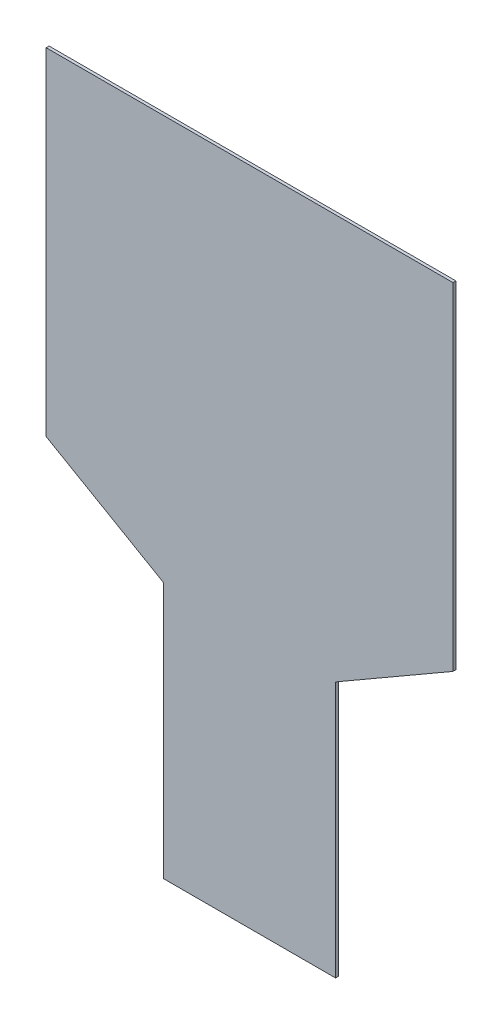
ISO-10303-21;
HEADER;
FILE_DESCRIPTION(('STEP AP214'),'2;1');
FILE_NAME('part.step','',(''),(''),'','','');
FILE_SCHEMA(('AUTOMOTIVE_DESIGN { 1 0 10303 214 1 1 1 1 }'));
ENDSEC;
DATA;
#1=APPLICATION_CONTEXT('core data for automotive mechanical design processes');
#2=APPLICATION_PROTOCOL_DEFINITION('international standard','automotive_design',2000,#1);
#3=PRODUCT_CONTEXT('',#1,'mechanical');
#4=PRODUCT('Part','Part','',(#3));
#5=PRODUCT_RELATED_PRODUCT_CATEGORY('part','',(#4));
#6=PRODUCT_DEFINITION_FORMATION('','',#4);
#7=PRODUCT_DEFINITION_CONTEXT('part definition',#1,'design');
#8=PRODUCT_DEFINITION('design','',#6,#7);
#9=PRODUCT_DEFINITION_SHAPE('','',#8);
#10=(LENGTH_UNIT() NAMED_UNIT(*) SI_UNIT(.MILLI.,.METRE.));
#11=(NAMED_UNIT(*) PLANE_ANGLE_UNIT() SI_UNIT($,.RADIAN.));
#12=(NAMED_UNIT(*) SI_UNIT($,.STERADIAN.) SOLID_ANGLE_UNIT());
#13=UNCERTAINTY_MEASURE_WITH_UNIT(LENGTH_MEASURE(1.E-05),#10,'distance_accuracy_value','');
#14=(GEOMETRIC_REPRESENTATION_CONTEXT(3) GLOBAL_UNCERTAINTY_ASSIGNED_CONTEXT((#13)) GLOBAL_UNIT_ASSIGNED_CONTEXT((#10,
#11,#12)) REPRESENTATION_CONTEXT('',''));
#15=CARTESIAN_POINT('',(0.,0.,0.));
#16=DIRECTION('',(0.,0.,1.));
#17=DIRECTION('',(1.,0.,0.));
#18=AXIS2_PLACEMENT_3D('',#15,#16,#17);
#19=CARTESIAN_POINT('',(46.2376557351538,-31.2229924260094,1.5));
#20=DIRECTION('',(-1.,0.,0.));
#21=DIRECTION('',(0.,-1.,0.));
#22=AXIS2_PLACEMENT_3D('',#19,#20,#21);
#23=PLANE('',#22);
#24=DIRECTION('',(0.,1.,0.));
#25=VECTOR('',#24,1.);
#26=CARTESIAN_POINT('',(46.2376557351538,-31.2229924260094,0.));
#27=LINE('',#26,#25);
#28=CARTESIAN_POINT('',(46.2376557351538,-162.347348078992,0.));
#29=VERTEX_POINT('',#28);
#30=CARTESIAN_POINT('',(46.2376557351538,-31.2229924260094,0.));
#31=VERTEX_POINT('',#30);
#32=EDGE_CURVE('E129',#29,#31,#27,.T.);
#33=ORIENTED_EDGE('',*,*,#32,.T.);
#34=DIRECTION('',(0.,0.,-1.));
#35=VECTOR('',#34,1.);
#36=CARTESIAN_POINT('',(46.2376557351538,-31.2229924260094,1.5));
#37=LINE('',#36,#35);
#38=CARTESIAN_POINT('',(46.2376557351538,-31.2229924260094,1.5));
#39=VERTEX_POINT('',#38);
#40=EDGE_CURVE('E11',#39,#31,#37,.T.);
#41=ORIENTED_EDGE('',*,*,#40,.F.);
#42=DIRECTION('',(0.,1.,0.));
#43=VECTOR('',#42,1.);
#44=CARTESIAN_POINT('',(46.2376557351538,-31.2229924260094,1.5));
#45=LINE('',#44,#43);
#46=CARTESIAN_POINT('',(46.2376557351538,-162.347348078992,1.5));
#47=VERTEX_POINT('',#46);
#48=EDGE_CURVE('E143',#47,#39,#45,.T.);
#49=ORIENTED_EDGE('',*,*,#48,.F.);
#50=DIRECTION('',(0.,0.,-1.));
#51=VECTOR('',#50,1.);
#52=CARTESIAN_POINT('',(46.2376557351538,-162.347348078992,1.5));
#53=LINE('',#52,#51);
#54=EDGE_CURVE('E125',#47,#29,#53,.T.);
#55=ORIENTED_EDGE('',*,*,#54,.T.);
#56=EDGE_LOOP('',(#33,#41,#49,#55));
#57=FACE_BOUND('',#56,.T.);
#58=ADVANCED_FACE('F33',(#57),#23,.F.);
#59=CARTESIAN_POINT('',(106.237655735154,3.41802372536817,1.5));
#60=DIRECTION('',(-0.5,0.866025403784439,0.));
#61=DIRECTION('',(-0.866025403784439,-0.5,0.));
#62=AXIS2_PLACEMENT_3D('',#59,#60,#61);
#63=PLANE('',#62);
#64=DIRECTION('',(0.866025403784439,0.5,0.));
#65=VECTOR('',#64,1.);
#66=CARTESIAN_POINT('',(106.237655735154,3.41802372536817,0.));
#67=LINE('',#66,#65);
#68=CARTESIAN_POINT('',(106.237655735154,3.41802372536817,0.));
#69=VERTEX_POINT('',#68);
#70=EDGE_CURVE('E132',#31,#69,#67,.T.);
#71=ORIENTED_EDGE('',*,*,#70,.T.);
#72=DIRECTION('',(0.,0.,-1.));
#73=VECTOR('',#72,1.);
#74=CARTESIAN_POINT('',(106.237655735154,3.41802372536817,1.5));
#75=LINE('',#74,#73);
#76=CARTESIAN_POINT('',(106.237655735154,3.41802372536817,1.5));
#77=VERTEX_POINT('',#76);
#78=EDGE_CURVE('E41',#77,#69,#75,.T.);
#79=ORIENTED_EDGE('',*,*,#78,.F.);
#80=DIRECTION('',(0.866025403784439,0.5,0.));
#81=VECTOR('',#80,1.);
#82=CARTESIAN_POINT('',(106.237655735154,3.41802372536817,1.5));
#83=LINE('',#82,#81);
#84=EDGE_CURVE('E92',#39,#77,#83,.T.);
#85=ORIENTED_EDGE('',*,*,#84,.F.);
#86=ORIENTED_EDGE('',*,*,#40,.T.);
#87=EDGE_LOOP('',(#71,#79,#85,#86));
#88=FACE_BOUND('',#87,.T.);
#89=ADVANCED_FACE('F178',(#88),#63,.F.);
#90=CARTESIAN_POINT('',(106.237655735154,175.652651921008,1.5));
#91=DIRECTION('',(-1.,0.,0.));
#92=DIRECTION('',(0.,-1.,0.));
#93=AXIS2_PLACEMENT_3D('',#90,#91,#92);
#94=PLANE('',#93);
#95=DIRECTION('',(0.,1.,0.));
#96=VECTOR('',#95,1.);
#97=CARTESIAN_POINT('',(106.237655735154,175.652651921008,0.));
#98=LINE('',#97,#96);
#99=CARTESIAN_POINT('',(106.237655735154,175.652651921008,0.));
#100=VERTEX_POINT('',#99);
#101=EDGE_CURVE('E134',#69,#100,#98,.T.);
#102=ORIENTED_EDGE('',*,*,#101,.T.);
#103=DIRECTION('',(0.,0.,-1.));
#104=VECTOR('',#103,1.);
#105=CARTESIAN_POINT('',(106.237655735154,175.652651921008,1.5));
#106=LINE('',#105,#104);
#107=CARTESIAN_POINT('',(106.237655735154,175.652651921008,1.5));
#108=VERTEX_POINT('',#107);
#109=EDGE_CURVE('E150',#108,#100,#106,.T.);
#110=ORIENTED_EDGE('',*,*,#109,.F.);
#111=DIRECTION('',(0.,1.,0.));
#112=VECTOR('',#111,1.);
#113=CARTESIAN_POINT('',(106.237655735154,175.652651921008,1.5));
#114=LINE('',#113,#112);
#115=EDGE_CURVE('E158',#77,#108,#114,.T.);
#116=ORIENTED_EDGE('',*,*,#115,.F.);
#117=ORIENTED_EDGE('',*,*,#78,.T.);
#118=EDGE_LOOP('',(#102,#110,#116,#117));
#119=FACE_BOUND('',#118,.T.);
#120=ADVANCED_FACE('F156',(#119),#94,.F.);
#121=CARTESIAN_POINT('',(106.237655735154,175.652651921008,1.5));
#122=DIRECTION('',(0.,-1.,0.));
#123=DIRECTION('',(0.,0.,-1.));
#124=AXIS2_PLACEMENT_3D('',#121,#122,#123);
#125=PLANE('',#124);
#126=DIRECTION('',(-1.,0.,0.));
#127=VECTOR('',#126,1.);
#128=CARTESIAN_POINT('',(106.237655735154,175.652651921008,0.));
#129=LINE('',#128,#127);
#130=CARTESIAN_POINT('',(-101.762344264846,175.652651921008,0.));
#131=VERTEX_POINT('',#130);
#132=EDGE_CURVE('E136',#100,#131,#129,.T.);
#133=ORIENTED_EDGE('',*,*,#132,.T.);
#134=DIRECTION('',(0.,0.,-1.));
#135=VECTOR('',#134,1.);
#136=CARTESIAN_POINT('',(-101.762344264846,175.652651921008,1.5));
#137=LINE('',#136,#135);
#138=CARTESIAN_POINT('',(-101.762344264846,175.652651921008,1.5));
#139=VERTEX_POINT('',#138);
#140=EDGE_CURVE('E147',#139,#131,#137,.T.);
#141=ORIENTED_EDGE('',*,*,#140,.F.);
#142=DIRECTION('',(-1.,0.,0.));
#143=VECTOR('',#142,1.);
#144=CARTESIAN_POINT('',(106.237655735154,175.652651921008,1.5));
#145=LINE('',#144,#143);
#146=EDGE_CURVE('E170',#108,#139,#145,.T.);
#147=ORIENTED_EDGE('',*,*,#146,.F.);
#148=ORIENTED_EDGE('',*,*,#109,.T.);
#149=EDGE_LOOP('',(#133,#141,#147,#148));
#150=FACE_BOUND('',#149,.T.);
#151=ADVANCED_FACE('F166',(#150),#125,.F.);
#152=CARTESIAN_POINT('',(-101.762344264846,175.652651921008,1.5));
#153=DIRECTION('',(1.,0.,0.));
#154=DIRECTION('',(0.,1.,0.));
#155=AXIS2_PLACEMENT_3D('',#152,#153,#154);
#156=PLANE('',#155);
#157=DIRECTION('',(0.,-1.,0.));
#158=VECTOR('',#157,1.);
#159=CARTESIAN_POINT('',(-101.762344264846,175.652651921008,0.));
#160=LINE('',#159,#158);
#161=CARTESIAN_POINT('',(-101.762344264846,3.41802372536817,0.));
#162=VERTEX_POINT('',#161);
#163=EDGE_CURVE('E138',#131,#162,#160,.T.);
#164=ORIENTED_EDGE('',*,*,#163,.T.);
#165=DIRECTION('',(0.,0.,-1.));
#166=VECTOR('',#165,1.);
#167=CARTESIAN_POINT('',(-101.762344264846,3.41802372536817,1.5));
#168=LINE('',#167,#166);
#169=CARTESIAN_POINT('',(-101.762344264846,3.41802372536817,1.5));
#170=VERTEX_POINT('',#169);
#171=EDGE_CURVE('E120',#170,#162,#168,.T.);
#172=ORIENTED_EDGE('',*,*,#171,.F.);
#173=DIRECTION('',(0.,-1.,0.));
#174=VECTOR('',#173,1.);
#175=CARTESIAN_POINT('',(-101.762344264846,175.652651921008,1.5));
#176=LINE('',#175,#174);
#177=EDGE_CURVE('E111',#139,#170,#176,.T.);
#178=ORIENTED_EDGE('',*,*,#177,.F.);
#179=ORIENTED_EDGE('',*,*,#140,.T.);
#180=EDGE_LOOP('',(#164,#172,#178,#179));
#181=FACE_BOUND('',#180,.T.);
#182=ADVANCED_FACE('F169',(#181),#156,.F.);
#183=CARTESIAN_POINT('',(-101.762344264846,3.41802372536817,1.5));
#184=DIRECTION('',(0.5,0.866025403784439,0.));
#185=DIRECTION('',(-0.866025403784439,0.5,0.));
#186=AXIS2_PLACEMENT_3D('',#183,#184,#185);
#187=PLANE('',#186);
#188=DIRECTION('',(0.866025403784439,-0.5,0.));
#189=VECTOR('',#188,1.);
#190=CARTESIAN_POINT('',(-101.762344264846,3.41802372536817,0.));
#191=LINE('',#190,#189);
#192=CARTESIAN_POINT('',(-41.7623442648461,-31.2229924260094,0.));
#193=VERTEX_POINT('',#192);
#194=EDGE_CURVE('E119',#162,#193,#191,.T.);
#195=ORIENTED_EDGE('',*,*,#194,.T.);
#196=DIRECTION('',(0.,0.,-1.));
#197=VECTOR('',#196,1.);
#198=CARTESIAN_POINT('',(-41.7623442648461,-31.2229924260094,1.5));
#199=LINE('',#198,#197);
#200=CARTESIAN_POINT('',(-41.7623442648461,-31.2229924260094,1.5));
#201=VERTEX_POINT('',#200);
#202=EDGE_CURVE('E116',#201,#193,#199,.T.);
#203=ORIENTED_EDGE('',*,*,#202,.F.);
#204=DIRECTION('',(0.866025403784439,-0.5,0.));
#205=VECTOR('',#204,1.);
#206=CARTESIAN_POINT('',(-101.762344264846,3.41802372536817,1.5));
#207=LINE('',#206,#205);
#208=EDGE_CURVE('E105',#170,#201,#207,.T.);
#209=ORIENTED_EDGE('',*,*,#208,.F.);
#210=ORIENTED_EDGE('',*,*,#171,.T.);
#211=EDGE_LOOP('',(#195,#203,#209,#210));
#212=FACE_BOUND('',#211,.T.);
#213=ADVANCED_FACE('F117',(#212),#187,.F.);
#214=CARTESIAN_POINT('',(-41.7623442648461,-31.2229924260094,1.5));
#215=DIRECTION('',(1.,0.,0.));
#216=DIRECTION('',(0.,1.,0.));
#217=AXIS2_PLACEMENT_3D('',#214,#215,#216);
#218=PLANE('',#217);
#219=DIRECTION('',(0.,-1.,0.));
#220=VECTOR('',#219,1.);
#221=CARTESIAN_POINT('',(-41.7623442648461,-31.2229924260094,0.));
#222=LINE('',#221,#220);
#223=CARTESIAN_POINT('',(-41.7623442648461,-162.347348078992,0.));
#224=VERTEX_POINT('',#223);
#225=EDGE_CURVE('E78',#193,#224,#222,.T.);
#226=ORIENTED_EDGE('',*,*,#225,.T.);
#227=DIRECTION('',(0.,0.,-1.));
#228=VECTOR('',#227,1.);
#229=CARTESIAN_POINT('',(-41.7623442648461,-162.347348078992,1.5));
#230=LINE('',#229,#228);
#231=CARTESIAN_POINT('',(-41.7623442648461,-162.347348078992,1.5));
#232=VERTEX_POINT('',#231);
#233=EDGE_CURVE('E121',#232,#224,#230,.T.);
#234=ORIENTED_EDGE('',*,*,#233,.F.);
#235=DIRECTION('',(0.,-1.,0.));
#236=VECTOR('',#235,1.);
#237=CARTESIAN_POINT('',(-41.7623442648461,-31.2229924260094,1.5));
#238=LINE('',#237,#236);
#239=EDGE_CURVE('E109',#201,#232,#238,.T.);
#240=ORIENTED_EDGE('',*,*,#239,.F.);
#241=ORIENTED_EDGE('',*,*,#202,.T.);
#242=EDGE_LOOP('',(#226,#234,#240,#241));
#243=FACE_BOUND('',#242,.T.);
#244=ADVANCED_FACE('F123',(#243),#218,.F.);
#245=CARTESIAN_POINT('',(-41.7623442648461,-162.347348078992,1.5));
#246=DIRECTION('',(0.,1.,0.));
#247=DIRECTION('',(0.,0.,1.));
#248=AXIS2_PLACEMENT_3D('',#245,#246,#247);
#249=PLANE('',#248);
#250=DIRECTION('',(1.,0.,0.));
#251=VECTOR('',#250,1.);
#252=CARTESIAN_POINT('',(-41.7623442648461,-162.347348078992,0.));
#253=LINE('',#252,#251);
#254=EDGE_CURVE('E84',#224,#29,#253,.T.);
#255=ORIENTED_EDGE('',*,*,#254,.T.);
#256=ORIENTED_EDGE('',*,*,#54,.F.);
#257=DIRECTION('',(1.,0.,0.));
#258=VECTOR('',#257,1.);
#259=CARTESIAN_POINT('',(-41.7623442648461,-162.347348078992,1.5));
#260=LINE('',#259,#258);
#261=EDGE_CURVE('E49',#232,#47,#260,.T.);
#262=ORIENTED_EDGE('',*,*,#261,.F.);
#263=ORIENTED_EDGE('',*,*,#233,.T.);
#264=EDGE_LOOP('',(#255,#256,#262,#263));
#265=FACE_BOUND('',#264,.T.);
#266=ADVANCED_FACE('F194',(#265),#249,.F.);
#267=CARTESIAN_POINT('',(0.,0.,1.5));
#268=DIRECTION('',(0.,0.,1.));
#269=DIRECTION('',(1.,0.,0.));
#270=AXIS2_PLACEMENT_3D('',#267,#268,#269);
#271=PLANE('',#270);
#272=ORIENTED_EDGE('',*,*,#48,.T.);
#273=ORIENTED_EDGE('',*,*,#84,.T.);
#274=ORIENTED_EDGE('',*,*,#115,.T.);
#275=ORIENTED_EDGE('',*,*,#146,.T.);
#276=ORIENTED_EDGE('',*,*,#177,.T.);
#277=ORIENTED_EDGE('',*,*,#208,.T.);
#278=ORIENTED_EDGE('',*,*,#239,.T.);
#279=ORIENTED_EDGE('',*,*,#261,.T.);
#280=EDGE_LOOP('',(#272,#273,#274,#275,#276,#277,#278,#279));
#281=FACE_BOUND('',#280,.T.);
#282=ADVANCED_FACE('F107',(#281),#271,.T.);
#283=CARTESIAN_POINT('',(0.,0.,0.));
#284=DIRECTION('',(0.,0.,1.));
#285=DIRECTION('',(1.,0.,0.));
#286=AXIS2_PLACEMENT_3D('',#283,#284,#285);
#287=PLANE('',#286);
#288=ORIENTED_EDGE('',*,*,#32,.F.);
#289=ORIENTED_EDGE('',*,*,#254,.F.);
#290=ORIENTED_EDGE('',*,*,#225,.F.);
#291=ORIENTED_EDGE('',*,*,#194,.F.);
#292=ORIENTED_EDGE('',*,*,#163,.F.);
#293=ORIENTED_EDGE('',*,*,#132,.F.);
#294=ORIENTED_EDGE('',*,*,#101,.F.);
#295=ORIENTED_EDGE('',*,*,#70,.F.);
#296=EDGE_LOOP('',(#288,#289,#290,#291,#292,#293,#294,#295));
#297=FACE_BOUND('',#296,.T.);
#298=ADVANCED_FACE('F162',(#297),#287,.F.);
#299=CLOSED_SHELL('',(#58,#89,#120,#151,#182,#213,#244,#266,#282,#298));
#300=MANIFOLD_SOLID_BREP('B2',#299);
#301=ADVANCED_BREP_SHAPE_REPRESENTATION('',(#18,#300),#14);
#302=SHAPE_DEFINITION_REPRESENTATION(#9,#301);
ENDSEC;
END-ISO-10303-21;
